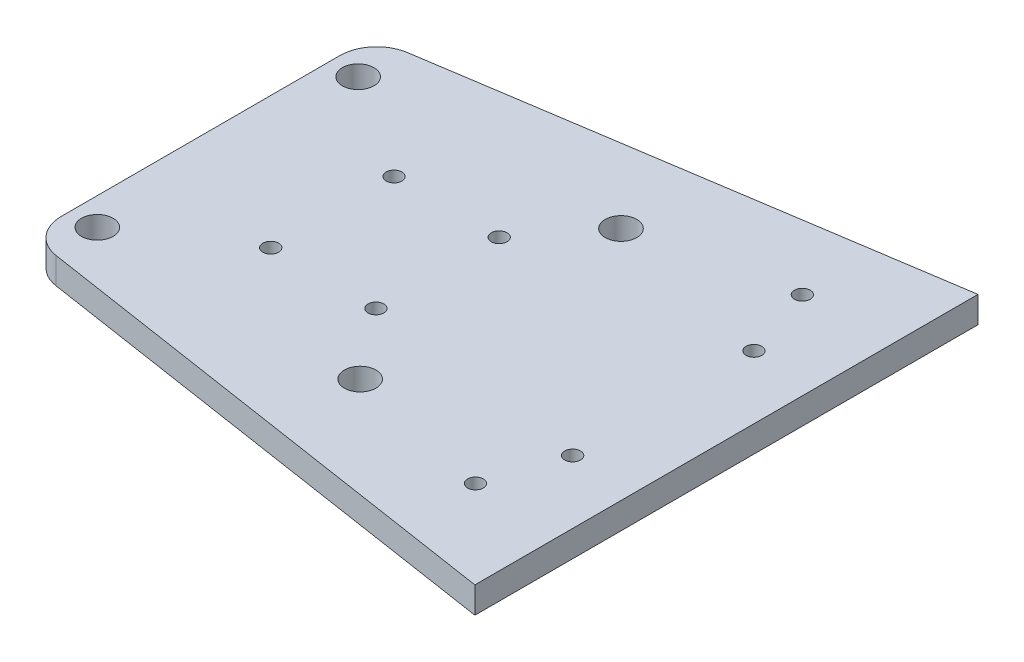
ISO-10303-21;
HEADER;
FILE_DESCRIPTION(('STEP AP214'),'2;1');
FILE_NAME('part.step','',(''),(''),'','','');
FILE_SCHEMA(('AUTOMOTIVE_DESIGN { 1 0 10303 214 1 1 1 1 }'));
ENDSEC;
DATA;
#1=APPLICATION_CONTEXT('core data for automotive mechanical design processes');
#2=APPLICATION_PROTOCOL_DEFINITION('international standard','automotive_design',2000,#1);
#3=PRODUCT_CONTEXT('',#1,'mechanical');
#4=PRODUCT('Part','Part','',(#3));
#5=PRODUCT_RELATED_PRODUCT_CATEGORY('part','',(#4));
#6=PRODUCT_DEFINITION_FORMATION('','',#4);
#7=PRODUCT_DEFINITION_CONTEXT('part definition',#1,'design');
#8=PRODUCT_DEFINITION('design','',#6,#7);
#9=PRODUCT_DEFINITION_SHAPE('','',#8);
#10=(LENGTH_UNIT() NAMED_UNIT(*) SI_UNIT(.MILLI.,.METRE.));
#11=(NAMED_UNIT(*) PLANE_ANGLE_UNIT() SI_UNIT($,.RADIAN.));
#12=(NAMED_UNIT(*) SI_UNIT($,.STERADIAN.) SOLID_ANGLE_UNIT());
#13=UNCERTAINTY_MEASURE_WITH_UNIT(LENGTH_MEASURE(1.E-05),#10,'distance_accuracy_value','');
#14=(GEOMETRIC_REPRESENTATION_CONTEXT(3) GLOBAL_UNCERTAINTY_ASSIGNED_CONTEXT((#13)) GLOBAL_UNIT_ASSIGNED_CONTEXT((#10,
#11,#12)) REPRESENTATION_CONTEXT('',''));
#15=CARTESIAN_POINT('',(0.,0.,0.));
#16=DIRECTION('',(0.,0.,1.));
#17=DIRECTION('',(1.,0.,0.));
#18=AXIS2_PLACEMENT_3D('',#15,#16,#17);
#19=CARTESIAN_POINT('',(100.,0.,0.));
#20=DIRECTION('',(1.,0.,0.));
#21=DIRECTION('',(0.,0.,-1.));
#22=AXIS2_PLACEMENT_3D('',#19,#20,#21);
#23=PLANE('',#22);
#24=DIRECTION('',(0.,1.,0.));
#25=VECTOR('',#24,1.);
#26=CARTESIAN_POINT('',(100.,5.,-47.8337365303758));
#27=LINE('',#26,#25);
#28=CARTESIAN_POINT('',(100.,0.,-47.8337365303758));
#29=VERTEX_POINT('',#28);
#30=CARTESIAN_POINT('',(100.,5.,-47.8337365303758));
#31=VERTEX_POINT('',#30);
#32=EDGE_CURVE('E96',#29,#31,#27,.T.);
#33=ORIENTED_EDGE('',*,*,#32,.T.);
#34=DIRECTION('',(0.,0.,1.));
#35=VECTOR('',#34,1.);
#36=CARTESIAN_POINT('',(100.,5.,73.));
#37=LINE('',#36,#35);
#38=CARTESIAN_POINT('',(100.,5.,47.8337365303758));
#39=VERTEX_POINT('',#38);
#40=EDGE_CURVE('E108',#31,#39,#37,.T.);
#41=ORIENTED_EDGE('',*,*,#40,.T.);
#42=DIRECTION('',(0.,-1.,0.));
#43=VECTOR('',#42,1.);
#44=CARTESIAN_POINT('',(100.,5.,47.8337365303758));
#45=LINE('',#44,#43);
#46=CARTESIAN_POINT('',(100.,0.,47.8337365303758));
#47=VERTEX_POINT('',#46);
#48=EDGE_CURVE('E110',#39,#47,#45,.T.);
#49=ORIENTED_EDGE('',*,*,#48,.T.);
#50=DIRECTION('',(0.,0.,1.));
#51=VECTOR('',#50,1.);
#52=CARTESIAN_POINT('',(100.,0.,73.));
#53=LINE('',#52,#51);
#54=EDGE_CURVE('E109',#29,#47,#53,.T.);
#55=ORIENTED_EDGE('',*,*,#54,.F.);
#56=EDGE_LOOP('',(#33,#41,#49,#55));
#57=FACE_BOUND('',#56,.T.);
#58=ADVANCED_FACE('F36',(#57),#23,.T.);
#59=CARTESIAN_POINT('',(7.,5.,-26.4915464626525));
#60=DIRECTION('',(0.,-1.,0.));
#61=DIRECTION('',(0.,0.,-1.));
#62=AXIS2_PLACEMENT_3D('',#59,#60,#61);
#63=CYLINDRICAL_SURFACE('',#62,7.);
#64=CARTESIAN_POINT('',(7.,5.,-26.4915464626525));
#65=DIRECTION('',(0.,-1.,0.));
#66=DIRECTION('',(0.,0.,-1.));
#67=AXIS2_PLACEMENT_3D('',#64,#65,#66);
#68=CIRCLE('',#67,7.);
#69=CARTESIAN_POINT('',(5.93903881989982,5.,-33.4106765650802));
#70=VERTEX_POINT('',#69);
#71=CARTESIAN_POINT('',(0.,5.,-26.4915464626525));
#72=VERTEX_POINT('',#71);
#73=EDGE_CURVE('E180',#70,#72,#68,.F.);
#74=ORIENTED_EDGE('',*,*,#73,.F.);
#75=DIRECTION('',(0.,-1.,0.));
#76=VECTOR('',#75,1.);
#77=CARTESIAN_POINT('',(5.93903881989984,5.,-33.4106765650802));
#78=LINE('',#77,#76);
#79=CARTESIAN_POINT('',(5.93903881989982,0.,-33.4106765650802));
#80=VERTEX_POINT('',#79);
#81=EDGE_CURVE('E99',#80,#70,#78,.F.);
#82=ORIENTED_EDGE('',*,*,#81,.F.);
#83=CARTESIAN_POINT('',(7.,0.,-26.4915464626525));
#84=DIRECTION('',(0.,-1.,0.));
#85=DIRECTION('',(0.,0.,-1.));
#86=AXIS2_PLACEMENT_3D('',#83,#84,#85);
#87=CIRCLE('',#86,7.);
#88=CARTESIAN_POINT('',(0.,0.,-26.4915464626525));
#89=VERTEX_POINT('',#88);
#90=EDGE_CURVE('E190',#89,#80,#87,.T.);
#91=ORIENTED_EDGE('',*,*,#90,.F.);
#92=DIRECTION('',(0.,-1.,0.));
#93=VECTOR('',#92,1.);
#94=CARTESIAN_POINT('',(0.,5.,-26.4915464626525));
#95=LINE('',#94,#93);
#96=EDGE_CURVE('E188',#72,#89,#95,.T.);
#97=ORIENTED_EDGE('',*,*,#96,.F.);
#98=EDGE_LOOP('',(#74,#82,#91,#97));
#99=FACE_BOUND('',#98,.T.);
#100=ADVANCED_FACE('F205',(#99),#63,.T.);
#101=CARTESIAN_POINT('',(0.,5.,19.6247424199696));
#102=DIRECTION('',(1.,0.,0.));
#103=DIRECTION('',(0.,0.,-1.));
#104=AXIS2_PLACEMENT_3D('',#101,#102,#103);
#105=PLANE('',#104);
#106=DIRECTION('',(0.,0.,1.));
#107=VECTOR('',#106,1.);
#108=CARTESIAN_POINT('',(0.,0.,19.6247424199696));
#109=LINE('',#108,#107);
#110=CARTESIAN_POINT('',(0.,0.,26.4915464626525));
#111=VERTEX_POINT('',#110);
#112=EDGE_CURVE('E120',#89,#111,#109,.T.);
#113=ORIENTED_EDGE('',*,*,#112,.T.);
#114=DIRECTION('',(0.,-1.,0.));
#115=VECTOR('',#114,1.);
#116=CARTESIAN_POINT('',(0.,5.,26.4915464626525));
#117=LINE('',#116,#115);
#118=CARTESIAN_POINT('',(0.,5.,26.4915464626525));
#119=VERTEX_POINT('',#118);
#120=EDGE_CURVE('E186',#111,#119,#117,.F.);
#121=ORIENTED_EDGE('',*,*,#120,.T.);
#122=DIRECTION('',(0.,0.,1.));
#123=VECTOR('',#122,1.);
#124=CARTESIAN_POINT('',(0.,5.,-32.5));
#125=LINE('',#124,#123);
#126=EDGE_CURVE('E103',#72,#119,#125,.T.);
#127=ORIENTED_EDGE('',*,*,#126,.F.);
#128=ORIENTED_EDGE('',*,*,#96,.T.);
#129=EDGE_LOOP('',(#113,#121,#127,#128));
#130=FACE_BOUND('',#129,.T.);
#131=ADVANCED_FACE('F207',(#130),#105,.F.);
#132=CARTESIAN_POINT('',(7.00000000000001,5.,26.4915464626525));
#133=DIRECTION('',(0.,-1.,0.));
#134=DIRECTION('',(0.,0.,-1.));
#135=AXIS2_PLACEMENT_3D('',#132,#133,#134);
#136=CYLINDRICAL_SURFACE('',#135,7.);
#137=CARTESIAN_POINT('',(7.00000000000001,5.,26.4915464626525));
#138=DIRECTION('',(0.,-1.,0.));
#139=DIRECTION('',(0.,0.,-1.));
#140=AXIS2_PLACEMENT_3D('',#137,#138,#139);
#141=CIRCLE('',#140,7.);
#142=CARTESIAN_POINT('',(5.93903881989982,5.,33.4106765650802));
#143=VERTEX_POINT('',#142);
#144=EDGE_CURVE('E61',#119,#143,#141,.F.);
#145=ORIENTED_EDGE('',*,*,#144,.F.);
#146=ORIENTED_EDGE('',*,*,#120,.F.);
#147=CARTESIAN_POINT('',(7.00000000000001,0.,26.4915464626525));
#148=DIRECTION('',(0.,-1.,0.));
#149=DIRECTION('',(0.,0.,-1.));
#150=AXIS2_PLACEMENT_3D('',#147,#148,#149);
#151=CIRCLE('',#150,7.);
#152=CARTESIAN_POINT('',(5.93903881989982,0.,33.4106765650802));
#153=VERTEX_POINT('',#152);
#154=EDGE_CURVE('E53',#153,#111,#151,.T.);
#155=ORIENTED_EDGE('',*,*,#154,.F.);
#156=DIRECTION('',(0.,-1.,0.));
#157=VECTOR('',#156,1.);
#158=CARTESIAN_POINT('',(5.93903881989984,5.,33.4106765650802));
#159=LINE('',#158,#157);
#160=EDGE_CURVE('E118',#143,#153,#159,.T.);
#161=ORIENTED_EDGE('',*,*,#160,.F.);
#162=EDGE_LOOP('',(#145,#146,#155,#161));
#163=FACE_BOUND('',#162,.T.);
#164=ADVANCED_FACE('F214',(#163),#136,.T.);
#165=CARTESIAN_POINT('',(116.181163828613,5.,50.3149135594038));
#166=DIRECTION('',(0.151565882871454,0.,-0.988447157489664));
#167=DIRECTION('',(-0.988447157489664,0.,-0.151565882871454));
#168=AXIS2_PLACEMENT_3D('',#165,#166,#167);
#169=PLANE('',#168);
#170=ORIENTED_EDGE('',*,*,#48,.F.);
#171=DIRECTION('',(0.988447157489664,0.,0.151565882871454));
#172=VECTOR('',#171,1.);
#173=CARTESIAN_POINT('',(116.181163828613,5.,50.3149135594038));
#174=LINE('',#173,#172);
#175=EDGE_CURVE('E113',#143,#39,#174,.T.);
#176=ORIENTED_EDGE('',*,*,#175,.F.);
#177=ORIENTED_EDGE('',*,*,#160,.T.);
#178=DIRECTION('',(0.988447157489664,0.,0.151565882871454));
#179=VECTOR('',#178,1.);
#180=CARTESIAN_POINT('',(116.181163828613,0.,50.3149135594038));
#181=LINE('',#180,#179);
#182=EDGE_CURVE('E102',#153,#47,#181,.T.);
#183=ORIENTED_EDGE('',*,*,#182,.T.);
#184=EDGE_LOOP('',(#170,#176,#177,#183));
#185=FACE_BOUND('',#184,.T.);
#186=ADVANCED_FACE('F192',(#185),#169,.F.);
#187=CARTESIAN_POINT('',(116.181163828613,5.,-50.3149135594038));
#188=DIRECTION('',(0.151565882871454,0.,0.988447157489664));
#189=DIRECTION('',(0.988447157489664,0.,-0.151565882871454));
#190=AXIS2_PLACEMENT_3D('',#187,#188,#189);
#191=PLANE('',#190);
#192=ORIENTED_EDGE('',*,*,#32,.F.);
#193=DIRECTION('',(-0.988447157489664,0.,0.151565882871454));
#194=VECTOR('',#193,1.);
#195=CARTESIAN_POINT('',(116.181163828613,0.,-50.3149135594038));
#196=LINE('',#195,#194);
#197=EDGE_CURVE('E40',#29,#80,#196,.T.);
#198=ORIENTED_EDGE('',*,*,#197,.T.);
#199=ORIENTED_EDGE('',*,*,#81,.T.);
#200=DIRECTION('',(-0.988447157489664,0.,0.151565882871454));
#201=VECTOR('',#200,1.);
#202=CARTESIAN_POINT('',(116.181163828613,5.,-50.3149135594038));
#203=LINE('',#202,#201);
#204=EDGE_CURVE('E93',#31,#70,#203,.T.);
#205=ORIENTED_EDGE('',*,*,#204,.F.);
#206=EDGE_LOOP('',(#192,#198,#199,#205));
#207=FACE_BOUND('',#206,.T.);
#208=ADVANCED_FACE('F95',(#207),#191,.F.);
#209=CARTESIAN_POINT('',(83.3560522473145,-5.,-31.0798565818886));
#210=DIRECTION('',(0.,1.,0.));
#211=DIRECTION('',(0.,0.,1.));
#212=AXIS2_PLACEMENT_3D('',#209,#210,#211);
#213=CYLINDRICAL_SURFACE('',#212,1.5);
#214=CARTESIAN_POINT('',(83.3560522473145,0.,-31.0798565818886));
#215=DIRECTION('',(0.,-1.,0.));
#216=DIRECTION('',(0.,0.,-1.));
#217=AXIS2_PLACEMENT_3D('',#214,#215,#216);
#218=CIRCLE('',#217,1.5);
#219=CARTESIAN_POINT('',(83.3560522473145,0.,-32.5798565818885));
#220=VERTEX_POINT('',#219);
#221=EDGE_CURVE('E154',#220,#220,#218,.T.);
#222=ORIENTED_EDGE('',*,*,#221,.T.);
#223=EDGE_LOOP('',(#222));
#224=FACE_BOUND('',#223,.T.);
#225=CARTESIAN_POINT('',(83.3560522473145,5.,-31.0798565818886));
#226=DIRECTION('',(0.,1.,0.));
#227=DIRECTION('',(0.,0.,1.));
#228=AXIS2_PLACEMENT_3D('',#225,#226,#227);
#229=CIRCLE('',#228,1.5);
#230=CARTESIAN_POINT('',(83.3560522473145,5.,-29.5798565818886));
#231=VERTEX_POINT('',#230);
#232=EDGE_CURVE('E170',#231,#231,#229,.T.);
#233=ORIENTED_EDGE('',*,*,#232,.T.);
#234=EDGE_LOOP('',(#233));
#235=FACE_BOUND('',#234,.T.);
#236=ADVANCED_FACE('F250',(#224,#235),#213,.F.);
#237=CARTESIAN_POINT('',(83.3560522473145,-5.,31.0798565818886));
#238=DIRECTION('',(0.,1.,0.));
#239=DIRECTION('',(0.,0.,1.));
#240=AXIS2_PLACEMENT_3D('',#237,#238,#239);
#241=CYLINDRICAL_SURFACE('',#240,1.5);
#242=CARTESIAN_POINT('',(83.3560522473145,0.,31.0798565818886));
#243=DIRECTION('',(0.,-1.,0.));
#244=DIRECTION('',(0.,0.,-1.));
#245=AXIS2_PLACEMENT_3D('',#242,#243,#244);
#246=CIRCLE('',#245,1.5);
#247=CARTESIAN_POINT('',(83.3560522473145,0.,29.5798565818886));
#248=VERTEX_POINT('',#247);
#249=EDGE_CURVE('E423',#248,#248,#246,.T.);
#250=ORIENTED_EDGE('',*,*,#249,.T.);
#251=EDGE_LOOP('',(#250));
#252=FACE_BOUND('',#251,.T.);
#253=CARTESIAN_POINT('',(83.3560522473145,5.,31.0798565818886));
#254=DIRECTION('',(0.,1.,0.));
#255=DIRECTION('',(0.,0.,-1.));
#256=AXIS2_PLACEMENT_3D('',#253,#254,#255);
#257=CIRCLE('',#256,1.5);
#258=CARTESIAN_POINT('',(83.3560522473145,5.,29.5798565818886));
#259=VERTEX_POINT('',#258);
#260=EDGE_CURVE('E173',#259,#259,#257,.T.);
#261=ORIENTED_EDGE('',*,*,#260,.T.);
#262=EDGE_LOOP('',(#261));
#263=FACE_BOUND('',#262,.T.);
#264=ADVANCED_FACE('F244',(#252,#263),#241,.F.);
#265=CARTESIAN_POINT('',(45.0730657404143,-5.,-11.7227231676557));
#266=DIRECTION('',(0.,1.,0.));
#267=DIRECTION('',(0.,0.,1.));
#268=AXIS2_PLACEMENT_3D('',#265,#266,#267);
#269=CYLINDRICAL_SURFACE('',#268,1.5);
#270=CARTESIAN_POINT('',(45.0730657404143,0.,-11.7227231676557));
#271=DIRECTION('',(0.,-1.,0.));
#272=DIRECTION('',(0.,0.,-1.));
#273=AXIS2_PLACEMENT_3D('',#270,#271,#272);
#274=CIRCLE('',#273,1.5);
#275=CARTESIAN_POINT('',(45.0730657404143,0.,-13.2227231676557));
#276=VERTEX_POINT('',#275);
#277=EDGE_CURVE('E420',#276,#276,#274,.T.);
#278=ORIENTED_EDGE('',*,*,#277,.T.);
#279=EDGE_LOOP('',(#278));
#280=FACE_BOUND('',#279,.T.);
#281=CARTESIAN_POINT('',(45.0730657404143,5.,-11.7227231676557));
#282=DIRECTION('',(0.,1.,0.));
#283=DIRECTION('',(0.,0.,1.));
#284=AXIS2_PLACEMENT_3D('',#281,#282,#283);
#285=CIRCLE('',#284,1.5);
#286=CARTESIAN_POINT('',(45.0730657404143,5.,-10.2227231676557));
#287=VERTEX_POINT('',#286);
#288=EDGE_CURVE('E160',#287,#287,#285,.T.);
#289=ORIENTED_EDGE('',*,*,#288,.T.);
#290=EDGE_LOOP('',(#289));
#291=FACE_BOUND('',#290,.T.);
#292=ADVANCED_FACE('F240',(#280,#291),#269,.F.);
#293=CARTESIAN_POINT('',(25.0730657404143,-5.,11.7227231676557));
#294=DIRECTION('',(0.,1.,0.));
#295=DIRECTION('',(0.,0.,1.));
#296=AXIS2_PLACEMENT_3D('',#293,#294,#295);
#297=CYLINDRICAL_SURFACE('',#296,1.5);
#298=CARTESIAN_POINT('',(25.0730657404143,0.,11.7227231676557));
#299=DIRECTION('',(0.,-1.,0.));
#300=DIRECTION('',(0.,0.,-1.));
#301=AXIS2_PLACEMENT_3D('',#298,#299,#300);
#302=CIRCLE('',#301,1.5);
#303=CARTESIAN_POINT('',(25.0730657404143,0.,10.2227231676557));
#304=VERTEX_POINT('',#303);
#305=EDGE_CURVE('E415',#304,#304,#302,.T.);
#306=ORIENTED_EDGE('',*,*,#305,.T.);
#307=EDGE_LOOP('',(#306));
#308=FACE_BOUND('',#307,.T.);
#309=CARTESIAN_POINT('',(25.0730657404143,5.,11.7227231676557));
#310=DIRECTION('',(0.,1.,0.));
#311=DIRECTION('',(0.,0.,-1.));
#312=AXIS2_PLACEMENT_3D('',#309,#310,#311);
#313=CIRCLE('',#312,1.5);
#314=CARTESIAN_POINT('',(25.0730657404143,5.,10.2227231676557));
#315=VERTEX_POINT('',#314);
#316=EDGE_CURVE('E162',#315,#315,#313,.T.);
#317=ORIENTED_EDGE('',*,*,#316,.T.);
#318=EDGE_LOOP('',(#317));
#319=FACE_BOUND('',#318,.T.);
#320=ADVANCED_FACE('F236',(#308,#319),#297,.F.);
#321=CARTESIAN_POINT('',(45.0730657404143,-5.,11.7227231676557));
#322=DIRECTION('',(0.,1.,0.));
#323=DIRECTION('',(0.,0.,1.));
#324=AXIS2_PLACEMENT_3D('',#321,#322,#323);
#325=CYLINDRICAL_SURFACE('',#324,1.5);
#326=CARTESIAN_POINT('',(45.0730657404143,0.,11.7227231676557));
#327=DIRECTION('',(0.,-1.,0.));
#328=DIRECTION('',(0.,0.,-1.));
#329=AXIS2_PLACEMENT_3D('',#326,#327,#328);
#330=CIRCLE('',#329,1.5);
#331=CARTESIAN_POINT('',(45.0730657404143,0.,10.2227231676557));
#332=VERTEX_POINT('',#331);
#333=EDGE_CURVE('E411',#332,#332,#330,.T.);
#334=ORIENTED_EDGE('',*,*,#333,.T.);
#335=EDGE_LOOP('',(#334));
#336=FACE_BOUND('',#335,.T.);
#337=CARTESIAN_POINT('',(45.0730657404143,5.,11.7227231676557));
#338=DIRECTION('',(0.,1.,0.));
#339=DIRECTION('',(0.,0.,-1.));
#340=AXIS2_PLACEMENT_3D('',#337,#338,#339);
#341=CIRCLE('',#340,1.5);
#342=CARTESIAN_POINT('',(45.0730657404143,5.,10.2227231676557));
#343=VERTEX_POINT('',#342);
#344=EDGE_CURVE('E165',#343,#343,#341,.T.);
#345=ORIENTED_EDGE('',*,*,#344,.T.);
#346=EDGE_LOOP('',(#345));
#347=FACE_BOUND('',#346,.T.);
#348=ADVANCED_FACE('F239',(#336,#347),#325,.F.);
#349=CARTESIAN_POINT('',(87.9925832360036,-5.,-17.2314439170671));
#350=DIRECTION('',(0.,1.,0.));
#351=DIRECTION('',(0.,0.,1.));
#352=AXIS2_PLACEMENT_3D('',#349,#350,#351);
#353=CYLINDRICAL_SURFACE('',#352,1.5);
#354=CARTESIAN_POINT('',(87.9925832360036,0.,-17.2314439170671));
#355=DIRECTION('',(0.,-1.,0.));
#356=DIRECTION('',(0.,0.,-1.));
#357=AXIS2_PLACEMENT_3D('',#354,#355,#356);
#358=CIRCLE('',#357,1.5);
#359=CARTESIAN_POINT('',(87.9925832360036,0.,-18.7314439170671));
#360=VERTEX_POINT('',#359);
#361=EDGE_CURVE('E391',#360,#360,#358,.T.);
#362=ORIENTED_EDGE('',*,*,#361,.T.);
#363=EDGE_LOOP('',(#362));
#364=FACE_BOUND('',#363,.T.);
#365=CARTESIAN_POINT('',(87.9925832360036,5.,-17.2314439170671));
#366=DIRECTION('',(0.,1.,0.));
#367=DIRECTION('',(0.,0.,-1.));
#368=AXIS2_PLACEMENT_3D('',#365,#366,#367);
#369=CIRCLE('',#368,1.5);
#370=CARTESIAN_POINT('',(87.9925832360036,5.,-18.7314439170671));
#371=VERTEX_POINT('',#370);
#372=EDGE_CURVE('E45',#371,#371,#369,.T.);
#373=ORIENTED_EDGE('',*,*,#372,.T.);
#374=EDGE_LOOP('',(#373));
#375=FACE_BOUND('',#374,.T.);
#376=ADVANCED_FACE('F248',(#364,#375),#353,.F.);
#377=CARTESIAN_POINT('',(87.9925832360036,-5.,17.2314439170671));
#378=DIRECTION('',(0.,1.,0.));
#379=DIRECTION('',(0.,0.,1.));
#380=AXIS2_PLACEMENT_3D('',#377,#378,#379);
#381=CYLINDRICAL_SURFACE('',#380,1.5);
#382=CARTESIAN_POINT('',(87.9925832360036,0.,17.2314439170671));
#383=DIRECTION('',(0.,-1.,0.));
#384=DIRECTION('',(0.,0.,-1.));
#385=AXIS2_PLACEMENT_3D('',#382,#383,#384);
#386=CIRCLE('',#385,1.5);
#387=CARTESIAN_POINT('',(87.9925832360036,0.,15.7314439170671));
#388=VERTEX_POINT('',#387);
#389=EDGE_CURVE('E410',#388,#388,#386,.T.);
#390=ORIENTED_EDGE('',*,*,#389,.T.);
#391=EDGE_LOOP('',(#390));
#392=FACE_BOUND('',#391,.T.);
#393=CARTESIAN_POINT('',(87.9925832360036,5.,17.2314439170671));
#394=DIRECTION('',(0.,1.,0.));
#395=DIRECTION('',(0.,0.,1.));
#396=AXIS2_PLACEMENT_3D('',#393,#394,#395);
#397=CIRCLE('',#396,1.5);
#398=CARTESIAN_POINT('',(87.9925832360036,5.,18.7314439170671));
#399=VERTEX_POINT('',#398);
#400=EDGE_CURVE('E11',#399,#399,#397,.T.);
#401=ORIENTED_EDGE('',*,*,#400,.T.);
#402=EDGE_LOOP('',(#401));
#403=FACE_BOUND('',#402,.T.);
#404=ADVANCED_FACE('F234',(#392,#403),#381,.F.);
#405=CARTESIAN_POINT('',(25.0730657404143,-5.,-11.7227231676557));
#406=DIRECTION('',(0.,1.,0.));
#407=DIRECTION('',(0.,0.,1.));
#408=AXIS2_PLACEMENT_3D('',#405,#406,#407);
#409=CYLINDRICAL_SURFACE('',#408,1.5);
#410=CARTESIAN_POINT('',(25.0730657404143,0.,-11.7227231676557));
#411=DIRECTION('',(0.,-1.,0.));
#412=DIRECTION('',(0.,0.,-1.));
#413=AXIS2_PLACEMENT_3D('',#410,#411,#412);
#414=CIRCLE('',#413,1.5);
#415=CARTESIAN_POINT('',(25.0730657404143,0.,-13.2227231676557));
#416=VERTEX_POINT('',#415);
#417=EDGE_CURVE('E161',#416,#416,#414,.T.);
#418=ORIENTED_EDGE('',*,*,#417,.T.);
#419=EDGE_LOOP('',(#418));
#420=FACE_BOUND('',#419,.T.);
#421=CARTESIAN_POINT('',(25.0730657404143,5.,-11.7227231676557));
#422=DIRECTION('',(0.,1.,0.));
#423=DIRECTION('',(0.,0.,1.));
#424=AXIS2_PLACEMENT_3D('',#421,#422,#423);
#425=CIRCLE('',#424,1.5);
#426=CARTESIAN_POINT('',(25.0730657404143,5.,-10.2227231676557));
#427=VERTEX_POINT('',#426);
#428=EDGE_CURVE('E157',#427,#427,#425,.T.);
#429=ORIENTED_EDGE('',*,*,#428,.T.);
#430=EDGE_LOOP('',(#429));
#431=FACE_BOUND('',#430,.T.);
#432=ADVANCED_FACE('F227',(#420,#431),#409,.F.);
#433=CARTESIAN_POINT('',(5.2281324288205,0.,-24.7435812450603));
#434=DIRECTION('',(0.,1.,0.));
#435=DIRECTION('',(0.,0.,1.));
#436=AXIS2_PLACEMENT_3D('',#433,#434,#435);
#437=CYLINDRICAL_SURFACE('',#436,3.);
#438=CARTESIAN_POINT('',(5.2281324288205,0.,-24.7435812450603));
#439=DIRECTION('',(0.,1.,0.));
#440=DIRECTION('',(0.,0.,1.));
#441=AXIS2_PLACEMENT_3D('',#438,#439,#440);
#442=CIRCLE('',#441,3.);
#443=CARTESIAN_POINT('',(5.2281324288205,0.,-21.7435812450603));
#444=VERTEX_POINT('',#443);
#445=EDGE_CURVE('E136',#444,#444,#442,.T.);
#446=ORIENTED_EDGE('',*,*,#445,.F.);
#447=EDGE_LOOP('',(#446));
#448=FACE_BOUND('',#447,.T.);
#449=CARTESIAN_POINT('',(5.2281324288205,5.,-24.7435812450603));
#450=DIRECTION('',(0.,1.,0.));
#451=DIRECTION('',(0.,0.,1.));
#452=AXIS2_PLACEMENT_3D('',#449,#450,#451);
#453=CIRCLE('',#452,3.);
#454=CARTESIAN_POINT('',(5.2281324288205,5.,-21.7435812450603));
#455=VERTEX_POINT('',#454);
#456=EDGE_CURVE('E146',#455,#455,#453,.T.);
#457=ORIENTED_EDGE('',*,*,#456,.T.);
#458=EDGE_LOOP('',(#457));
#459=FACE_BOUND('',#458,.T.);
#460=ADVANCED_FACE('F223',(#448,#459),#437,.F.);
#461=CARTESIAN_POINT('',(55.2084296904433,0.,24.8572967200258));
#462=DIRECTION('',(0.,1.,0.));
#463=DIRECTION('',(0.,0.,1.));
#464=AXIS2_PLACEMENT_3D('',#461,#462,#463);
#465=CYLINDRICAL_SURFACE('',#464,3.);
#466=CARTESIAN_POINT('',(55.2084296904433,0.,24.8572967200258));
#467=DIRECTION('',(0.,1.,0.));
#468=DIRECTION('',(0.,0.,1.));
#469=AXIS2_PLACEMENT_3D('',#466,#467,#468);
#470=CIRCLE('',#469,3.);
#471=CARTESIAN_POINT('',(55.2084296904433,0.,27.8572967200258));
#472=VERTEX_POINT('',#471);
#473=EDGE_CURVE('E143',#472,#472,#470,.T.);
#474=ORIENTED_EDGE('',*,*,#473,.F.);
#475=EDGE_LOOP('',(#474));
#476=FACE_BOUND('',#475,.T.);
#477=CARTESIAN_POINT('',(55.2084296904433,5.,24.8572967200258));
#478=DIRECTION('',(0.,1.,0.));
#479=DIRECTION('',(0.,0.,1.));
#480=AXIS2_PLACEMENT_3D('',#477,#478,#479);
#481=CIRCLE('',#480,3.);
#482=CARTESIAN_POINT('',(55.2084296904433,5.,27.8572967200258));
#483=VERTEX_POINT('',#482);
#484=EDGE_CURVE('E139',#483,#483,#481,.T.);
#485=ORIENTED_EDGE('',*,*,#484,.T.);
#486=EDGE_LOOP('',(#485));
#487=FACE_BOUND('',#486,.T.);
#488=ADVANCED_FACE('F220',(#476,#487),#465,.F.);
#489=CARTESIAN_POINT('',(55.2084296904433,0.,-24.7435812450603));
#490=DIRECTION('',(0.,1.,0.));
#491=DIRECTION('',(0.,0.,1.));
#492=AXIS2_PLACEMENT_3D('',#489,#490,#491);
#493=CYLINDRICAL_SURFACE('',#492,3.);
#494=CARTESIAN_POINT('',(55.2084296904433,0.,-24.7435812450603));
#495=DIRECTION('',(0.,1.,0.));
#496=DIRECTION('',(0.,0.,1.));
#497=AXIS2_PLACEMENT_3D('',#494,#495,#496);
#498=CIRCLE('',#497,3.);
#499=CARTESIAN_POINT('',(55.2084296904433,0.,-21.7435812450603));
#500=VERTEX_POINT('',#499);
#501=EDGE_CURVE('E142',#500,#500,#498,.T.);
#502=ORIENTED_EDGE('',*,*,#501,.F.);
#503=EDGE_LOOP('',(#502));
#504=FACE_BOUND('',#503,.T.);
#505=CARTESIAN_POINT('',(55.2084296904433,5.,-24.7435812450603));
#506=DIRECTION('',(0.,1.,0.));
#507=DIRECTION('',(0.,0.,1.));
#508=AXIS2_PLACEMENT_3D('',#505,#506,#507);
#509=CIRCLE('',#508,3.);
#510=CARTESIAN_POINT('',(55.2084296904433,5.,-21.7435812450603));
#511=VERTEX_POINT('',#510);
#512=EDGE_CURVE('E151',#511,#511,#509,.T.);
#513=ORIENTED_EDGE('',*,*,#512,.T.);
#514=EDGE_LOOP('',(#513));
#515=FACE_BOUND('',#514,.T.);
#516=ADVANCED_FACE('F201',(#504,#515),#493,.F.);
#517=CARTESIAN_POINT('',(5.22813242882052,0.,24.8572967200258));
#518=DIRECTION('',(0.,1.,0.));
#519=DIRECTION('',(0.,0.,1.));
#520=AXIS2_PLACEMENT_3D('',#517,#518,#519);
#521=CYLINDRICAL_SURFACE('',#520,3.);
#522=CARTESIAN_POINT('',(5.22813242882052,0.,24.8572967200258));
#523=DIRECTION('',(0.,1.,0.));
#524=DIRECTION('',(0.,0.,1.));
#525=AXIS2_PLACEMENT_3D('',#522,#523,#524);
#526=CIRCLE('',#525,3.);
#527=CARTESIAN_POINT('',(5.22813242882052,0.,27.8572967200258));
#528=VERTEX_POINT('',#527);
#529=EDGE_CURVE('E128',#528,#528,#526,.T.);
#530=ORIENTED_EDGE('',*,*,#529,.F.);
#531=EDGE_LOOP('',(#530));
#532=FACE_BOUND('',#531,.T.);
#533=CARTESIAN_POINT('',(5.22813242882052,5.,24.8572967200258));
#534=DIRECTION('',(0.,1.,0.));
#535=DIRECTION('',(0.,0.,1.));
#536=AXIS2_PLACEMENT_3D('',#533,#534,#535);
#537=CIRCLE('',#536,3.);
#538=CARTESIAN_POINT('',(5.22813242882052,5.,27.8572967200258));
#539=VERTEX_POINT('',#538);
#540=EDGE_CURVE('E133',#539,#539,#537,.T.);
#541=ORIENTED_EDGE('',*,*,#540,.T.);
#542=EDGE_LOOP('',(#541));
#543=FACE_BOUND('',#542,.T.);
#544=ADVANCED_FACE('F194',(#532,#543),#521,.F.);
#545=CARTESIAN_POINT('',(180.486918987026,0.,73.));
#546=DIRECTION('',(0.,-1.,0.));
#547=DIRECTION('',(0.,0.,-1.));
#548=AXIS2_PLACEMENT_3D('',#545,#546,#547);
#549=PLANE('',#548);
#550=ORIENTED_EDGE('',*,*,#529,.T.);
#551=EDGE_LOOP('',(#550));
#552=FACE_BOUND('',#551,.T.);
#553=ORIENTED_EDGE('',*,*,#501,.T.);
#554=EDGE_LOOP('',(#553));
#555=FACE_BOUND('',#554,.T.);
#556=ORIENTED_EDGE('',*,*,#473,.T.);
#557=EDGE_LOOP('',(#556));
#558=FACE_BOUND('',#557,.T.);
#559=ORIENTED_EDGE('',*,*,#445,.T.);
#560=EDGE_LOOP('',(#559));
#561=FACE_BOUND('',#560,.T.);
#562=ORIENTED_EDGE('',*,*,#417,.F.);
#563=EDGE_LOOP('',(#562));
#564=FACE_BOUND('',#563,.T.);
#565=ORIENTED_EDGE('',*,*,#389,.F.);
#566=EDGE_LOOP('',(#565));
#567=FACE_BOUND('',#566,.T.);
#568=ORIENTED_EDGE('',*,*,#361,.F.);
#569=EDGE_LOOP('',(#568));
#570=FACE_BOUND('',#569,.T.);
#571=ORIENTED_EDGE('',*,*,#333,.F.);
#572=EDGE_LOOP('',(#571));
#573=FACE_BOUND('',#572,.T.);
#574=ORIENTED_EDGE('',*,*,#305,.F.);
#575=EDGE_LOOP('',(#574));
#576=FACE_BOUND('',#575,.T.);
#577=ORIENTED_EDGE('',*,*,#277,.F.);
#578=EDGE_LOOP('',(#577));
#579=FACE_BOUND('',#578,.T.);
#580=ORIENTED_EDGE('',*,*,#249,.F.);
#581=EDGE_LOOP('',(#580));
#582=FACE_BOUND('',#581,.T.);
#583=ORIENTED_EDGE('',*,*,#221,.F.);
#584=EDGE_LOOP('',(#583));
#585=FACE_BOUND('',#584,.T.);
#586=ORIENTED_EDGE('',*,*,#197,.F.);
#587=ORIENTED_EDGE('',*,*,#54,.T.);
#588=ORIENTED_EDGE('',*,*,#182,.F.);
#589=ORIENTED_EDGE('',*,*,#154,.T.);
#590=ORIENTED_EDGE('',*,*,#112,.F.);
#591=ORIENTED_EDGE('',*,*,#90,.T.);
#592=EDGE_LOOP('',(#586,#587,#588,#589,#590,#591));
#593=FACE_BOUND('',#592,.T.);
#594=ADVANCED_FACE('F38',(#552,#555,#558,#561,#564,#567,#570,#573,#576,#579,#582,#585,#593),
#549,.T.);
#595=CARTESIAN_POINT('',(180.486918987026,5.,73.));
#596=DIRECTION('',(0.,-1.,0.));
#597=DIRECTION('',(0.,0.,-1.));
#598=AXIS2_PLACEMENT_3D('',#595,#596,#597);
#599=PLANE('',#598);
#600=ORIENTED_EDGE('',*,*,#540,.F.);
#601=EDGE_LOOP('',(#600));
#602=FACE_BOUND('',#601,.T.);
#603=ORIENTED_EDGE('',*,*,#512,.F.);
#604=EDGE_LOOP('',(#603));
#605=FACE_BOUND('',#604,.T.);
#606=ORIENTED_EDGE('',*,*,#484,.F.);
#607=EDGE_LOOP('',(#606));
#608=FACE_BOUND('',#607,.T.);
#609=ORIENTED_EDGE('',*,*,#456,.F.);
#610=EDGE_LOOP('',(#609));
#611=FACE_BOUND('',#610,.T.);
#612=ORIENTED_EDGE('',*,*,#428,.F.);
#613=EDGE_LOOP('',(#612));
#614=FACE_BOUND('',#613,.T.);
#615=ORIENTED_EDGE('',*,*,#400,.F.);
#616=EDGE_LOOP('',(#615));
#617=FACE_BOUND('',#616,.T.);
#618=ORIENTED_EDGE('',*,*,#372,.F.);
#619=EDGE_LOOP('',(#618));
#620=FACE_BOUND('',#619,.T.);
#621=ORIENTED_EDGE('',*,*,#344,.F.);
#622=EDGE_LOOP('',(#621));
#623=FACE_BOUND('',#622,.T.);
#624=ORIENTED_EDGE('',*,*,#316,.F.);
#625=EDGE_LOOP('',(#624));
#626=FACE_BOUND('',#625,.T.);
#627=ORIENTED_EDGE('',*,*,#288,.F.);
#628=EDGE_LOOP('',(#627));
#629=FACE_BOUND('',#628,.T.);
#630=ORIENTED_EDGE('',*,*,#260,.F.);
#631=EDGE_LOOP('',(#630));
#632=FACE_BOUND('',#631,.T.);
#633=ORIENTED_EDGE('',*,*,#232,.F.);
#634=EDGE_LOOP('',(#633));
#635=FACE_BOUND('',#634,.T.);
#636=ORIENTED_EDGE('',*,*,#40,.F.);
#637=ORIENTED_EDGE('',*,*,#204,.T.);
#638=ORIENTED_EDGE('',*,*,#73,.T.);
#639=ORIENTED_EDGE('',*,*,#126,.T.);
#640=ORIENTED_EDGE('',*,*,#144,.T.);
#641=ORIENTED_EDGE('',*,*,#175,.T.);
#642=EDGE_LOOP('',(#636,#637,#638,#639,#640,#641));
#643=FACE_BOUND('',#642,.T.);
#644=ADVANCED_FACE('F112',(#602,#605,#608,#611,#614,#617,#620,#623,#626,#629,#632,#635,#643),
#599,.F.);
#645=CLOSED_SHELL('',(#58,#100,#131,#164,#186,#208,#236,#264,#292,#320,#348,#376,#404,#432,#460,
#488,#516,#544,#594,#644));
#646=MANIFOLD_SOLID_BREP('B2',#645);
#647=ADVANCED_BREP_SHAPE_REPRESENTATION('',(#18,#646),#14);
#648=SHAPE_DEFINITION_REPRESENTATION(#9,#647);
ENDSEC;
END-ISO-10303-21;
